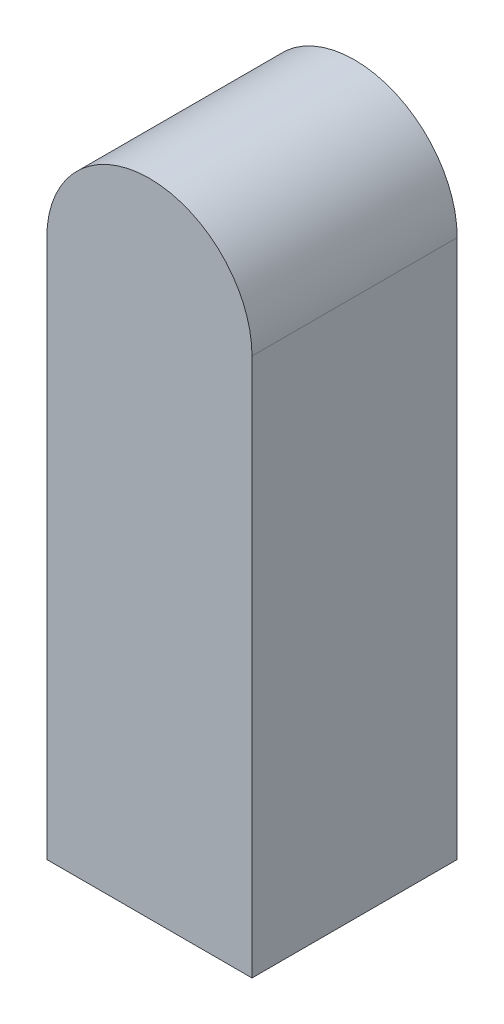
ISO-10303-21;
HEADER;
FILE_DESCRIPTION(('STEP AP214'),'2;1');
FILE_NAME('part.step','',(''),(''),'','','');
FILE_SCHEMA(('AUTOMOTIVE_DESIGN { 1 0 10303 214 1 1 1 1 }'));
ENDSEC;
DATA;
#1=APPLICATION_CONTEXT('core data for automotive mechanical design processes');
#2=APPLICATION_PROTOCOL_DEFINITION('international standard','automotive_design',2000,#1);
#3=PRODUCT_CONTEXT('',#1,'mechanical');
#4=PRODUCT('Part','Part','',(#3));
#5=PRODUCT_RELATED_PRODUCT_CATEGORY('part','',(#4));
#6=PRODUCT_DEFINITION_FORMATION('','',#4);
#7=PRODUCT_DEFINITION_CONTEXT('part definition',#1,'design');
#8=PRODUCT_DEFINITION('design','',#6,#7);
#9=PRODUCT_DEFINITION_SHAPE('','',#8);
#10=(LENGTH_UNIT() NAMED_UNIT(*) SI_UNIT(.MILLI.,.METRE.));
#11=(NAMED_UNIT(*) PLANE_ANGLE_UNIT() SI_UNIT($,.RADIAN.));
#12=(NAMED_UNIT(*) SI_UNIT($,.STERADIAN.) SOLID_ANGLE_UNIT());
#13=UNCERTAINTY_MEASURE_WITH_UNIT(LENGTH_MEASURE(1.E-05),#10,'distance_accuracy_value','');
#14=(GEOMETRIC_REPRESENTATION_CONTEXT(3) GLOBAL_UNCERTAINTY_ASSIGNED_CONTEXT((#13)) GLOBAL_UNIT_ASSIGNED_CONTEXT((#10,
#11,#12)) REPRESENTATION_CONTEXT('',''));
#15=CARTESIAN_POINT('',(0.,0.,0.));
#16=DIRECTION('',(0.,0.,1.));
#17=DIRECTION('',(1.,0.,0.));
#18=AXIS2_PLACEMENT_3D('',#15,#16,#17);
#19=CARTESIAN_POINT('',(-4.,21.,0.));
#20=DIRECTION('',(0.,0.,-1.));
#21=DIRECTION('',(-1.,0.,0.));
#22=AXIS2_PLACEMENT_3D('',#19,#20,#21);
#23=CYLINDRICAL_SURFACE('',#22,4.);
#24=DIRECTION('',(0.,0.,-1.));
#25=VECTOR('',#24,1.);
#26=CARTESIAN_POINT('',(0.,21.,8.));
#27=LINE('',#26,#25);
#28=CARTESIAN_POINT('',(0.,21.,0.));
#29=VERTEX_POINT('',#28);
#30=CARTESIAN_POINT('',(0.,21.,8.));
#31=VERTEX_POINT('',#30);
#32=EDGE_CURVE('E87',#29,#31,#27,.F.);
#33=ORIENTED_EDGE('',*,*,#32,.F.);
#34=CARTESIAN_POINT('',(-4.,21.,0.));
#35=DIRECTION('',(0.,0.,1.));
#36=DIRECTION('',(1.,0.,0.));
#37=AXIS2_PLACEMENT_3D('',#34,#35,#36);
#38=CIRCLE('',#37,4.);
#39=CARTESIAN_POINT('',(-8.,21.,0.));
#40=VERTEX_POINT('',#39);
#41=EDGE_CURVE('E43',#40,#29,#38,.F.);
#42=ORIENTED_EDGE('',*,*,#41,.F.);
#43=DIRECTION('',(0.,0.,-1.));
#44=VECTOR('',#43,1.);
#45=CARTESIAN_POINT('',(-8.,21.,8.));
#46=LINE('',#45,#44);
#47=CARTESIAN_POINT('',(-8.,21.,8.));
#48=VERTEX_POINT('',#47);
#49=EDGE_CURVE('E105',#48,#40,#46,.T.);
#50=ORIENTED_EDGE('',*,*,#49,.F.);
#51=CARTESIAN_POINT('',(-4.,21.,8.));
#52=DIRECTION('',(0.,0.,1.));
#53=DIRECTION('',(1.,0.,0.));
#54=AXIS2_PLACEMENT_3D('',#51,#52,#53);
#55=CIRCLE('',#54,4.);
#56=EDGE_CURVE('E11',#31,#48,#55,.T.);
#57=ORIENTED_EDGE('',*,*,#56,.F.);
#58=EDGE_LOOP('',(#33,#42,#50,#57));
#59=FACE_BOUND('',#58,.T.);
#60=ADVANCED_FACE('F35',(#59),#23,.T.);
#61=CARTESIAN_POINT('',(0.,0.,8.));
#62=DIRECTION('',(-1.,0.,0.));
#63=DIRECTION('',(0.,0.,1.));
#64=AXIS2_PLACEMENT_3D('',#61,#62,#63);
#65=PLANE('',#64);
#66=DIRECTION('',(0.,1.,0.));
#67=VECTOR('',#66,1.);
#68=CARTESIAN_POINT('',(0.,0.,0.));
#69=LINE('',#68,#67);
#70=CARTESIAN_POINT('',(0.,0.,0.));
#71=VERTEX_POINT('',#70);
#72=EDGE_CURVE('E97',#71,#29,#69,.T.);
#73=ORIENTED_EDGE('',*,*,#72,.T.);
#74=ORIENTED_EDGE('',*,*,#32,.T.);
#75=DIRECTION('',(0.,1.,0.));
#76=VECTOR('',#75,1.);
#77=CARTESIAN_POINT('',(0.,0.,8.));
#78=LINE('',#77,#76);
#79=CARTESIAN_POINT('',(0.,0.,8.));
#80=VERTEX_POINT('',#79);
#81=EDGE_CURVE('E78',#80,#31,#78,.T.);
#82=ORIENTED_EDGE('',*,*,#81,.F.);
#83=DIRECTION('',(0.,0.,-1.));
#84=VECTOR('',#83,1.);
#85=CARTESIAN_POINT('',(0.,0.,8.));
#86=LINE('',#85,#84);
#87=EDGE_CURVE('E88',#80,#71,#86,.T.);
#88=ORIENTED_EDGE('',*,*,#87,.T.);
#89=EDGE_LOOP('',(#73,#74,#82,#88));
#90=FACE_BOUND('',#89,.T.);
#91=ADVANCED_FACE('F110',(#90),#65,.F.);
#92=CARTESIAN_POINT('',(-8.,0.,8.));
#93=DIRECTION('',(1.,0.,0.));
#94=DIRECTION('',(0.,0.,-1.));
#95=AXIS2_PLACEMENT_3D('',#92,#93,#94);
#96=PLANE('',#95);
#97=DIRECTION('',(0.,-1.,0.));
#98=VECTOR('',#97,1.);
#99=CARTESIAN_POINT('',(-8.,0.,8.));
#100=LINE('',#99,#98);
#101=CARTESIAN_POINT('',(-8.,0.,8.));
#102=VERTEX_POINT('',#101);
#103=EDGE_CURVE('E71',#48,#102,#100,.T.);
#104=ORIENTED_EDGE('',*,*,#103,.F.);
#105=ORIENTED_EDGE('',*,*,#49,.T.);
#106=DIRECTION('',(0.,-1.,0.));
#107=VECTOR('',#106,1.);
#108=CARTESIAN_POINT('',(-8.,0.,0.));
#109=LINE('',#108,#107);
#110=CARTESIAN_POINT('',(-8.,0.,0.));
#111=VERTEX_POINT('',#110);
#112=EDGE_CURVE('E84',#40,#111,#109,.T.);
#113=ORIENTED_EDGE('',*,*,#112,.T.);
#114=DIRECTION('',(0.,0.,-1.));
#115=VECTOR('',#114,1.);
#116=CARTESIAN_POINT('',(-8.,0.,8.));
#117=LINE('',#116,#115);
#118=EDGE_CURVE('E81',#102,#111,#117,.T.);
#119=ORIENTED_EDGE('',*,*,#118,.F.);
#120=EDGE_LOOP('',(#104,#105,#113,#119));
#121=FACE_BOUND('',#120,.T.);
#122=ADVANCED_FACE('F82',(#121),#96,.F.);
#123=CARTESIAN_POINT('',(0.,0.,8.));
#124=DIRECTION('',(0.,1.,0.));
#125=DIRECTION('',(0.,0.,1.));
#126=AXIS2_PLACEMENT_3D('',#123,#124,#125);
#127=PLANE('',#126);
#128=DIRECTION('',(1.,0.,0.));
#129=VECTOR('',#128,1.);
#130=CARTESIAN_POINT('',(0.,0.,0.));
#131=LINE('',#130,#129);
#132=EDGE_CURVE('E101',#111,#71,#131,.T.);
#133=ORIENTED_EDGE('',*,*,#132,.T.);
#134=ORIENTED_EDGE('',*,*,#87,.F.);
#135=DIRECTION('',(1.,0.,0.));
#136=VECTOR('',#135,1.);
#137=CARTESIAN_POINT('',(0.,0.,8.));
#138=LINE('',#137,#136);
#139=EDGE_CURVE('E75',#102,#80,#138,.T.);
#140=ORIENTED_EDGE('',*,*,#139,.F.);
#141=ORIENTED_EDGE('',*,*,#118,.T.);
#142=EDGE_LOOP('',(#133,#134,#140,#141));
#143=FACE_BOUND('',#142,.T.);
#144=ADVANCED_FACE('F90',(#143),#127,.F.);
#145=CARTESIAN_POINT('',(0.,0.,8.));
#146=DIRECTION('',(0.,0.,1.));
#147=DIRECTION('',(1.,0.,0.));
#148=AXIS2_PLACEMENT_3D('',#145,#146,#147);
#149=PLANE('',#148);
#150=ORIENTED_EDGE('',*,*,#81,.T.);
#151=ORIENTED_EDGE('',*,*,#56,.T.);
#152=ORIENTED_EDGE('',*,*,#103,.T.);
#153=ORIENTED_EDGE('',*,*,#139,.T.);
#154=EDGE_LOOP('',(#150,#151,#152,#153));
#155=FACE_BOUND('',#154,.T.);
#156=ADVANCED_FACE('F73',(#155),#149,.T.);
#157=CARTESIAN_POINT('',(0.,0.,0.));
#158=DIRECTION('',(0.,0.,1.));
#159=DIRECTION('',(1.,0.,0.));
#160=AXIS2_PLACEMENT_3D('',#157,#158,#159);
#161=PLANE('',#160);
#162=ORIENTED_EDGE('',*,*,#112,.F.);
#163=ORIENTED_EDGE('',*,*,#41,.T.);
#164=ORIENTED_EDGE('',*,*,#72,.F.);
#165=ORIENTED_EDGE('',*,*,#132,.F.);
#166=EDGE_LOOP('',(#162,#163,#164,#165));
#167=FACE_BOUND('',#166,.T.);
#168=ADVANCED_FACE('F108',(#167),#161,.F.);
#169=CLOSED_SHELL('',(#60,#91,#122,#144,#156,#168));
#170=MANIFOLD_SOLID_BREP('B2',#169);
#171=ADVANCED_BREP_SHAPE_REPRESENTATION('',(#18,#170),#14);
#172=SHAPE_DEFINITION_REPRESENTATION(#9,#171);
ENDSEC;
END-ISO-10303-21;
